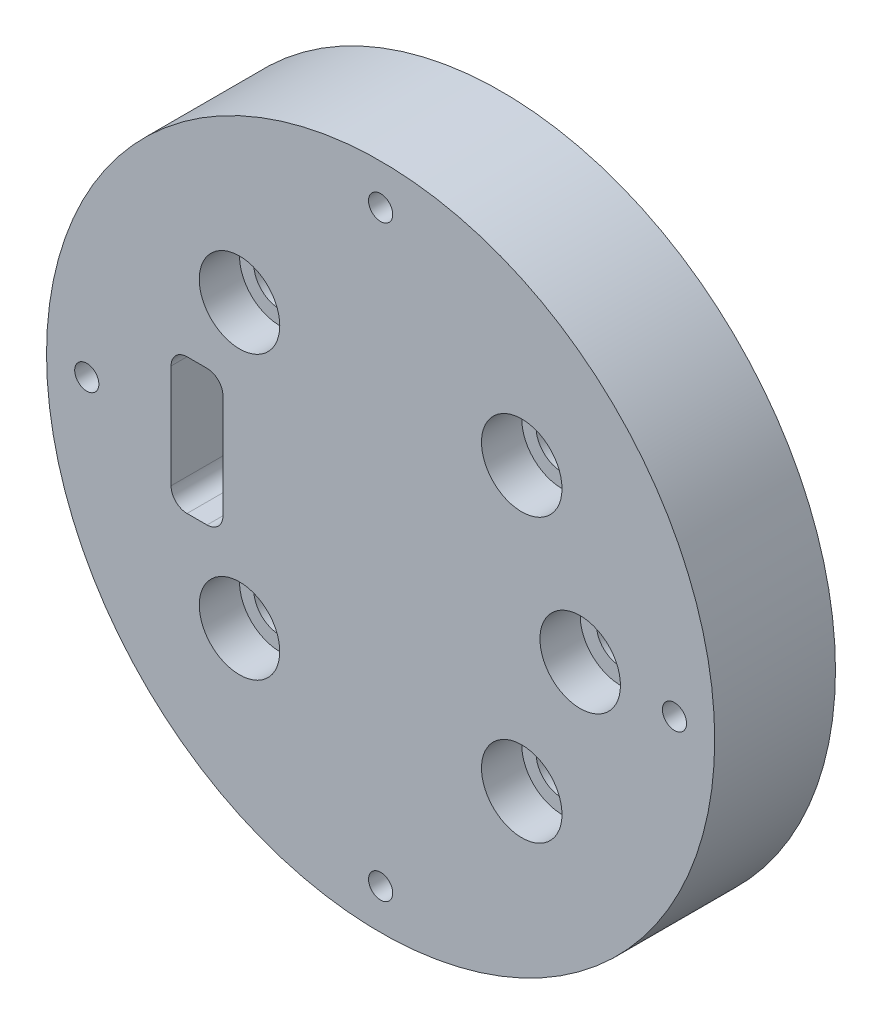
ISO-10303-21;
HEADER;
FILE_DESCRIPTION(('STEP AP214'),'2;1');
FILE_NAME('part.step','',(''),(''),'','','');
FILE_SCHEMA(('AUTOMOTIVE_DESIGN { 1 0 10303 214 1 1 1 1 }'));
ENDSEC;
DATA;
#1=APPLICATION_CONTEXT('core data for automotive mechanical design processes');
#2=APPLICATION_PROTOCOL_DEFINITION('international standard','automotive_design',2000,#1);
#3=PRODUCT_CONTEXT('',#1,'mechanical');
#4=PRODUCT('Part','Part','',(#3));
#5=PRODUCT_RELATED_PRODUCT_CATEGORY('part','',(#4));
#6=PRODUCT_DEFINITION_FORMATION('','',#4);
#7=PRODUCT_DEFINITION_CONTEXT('part definition',#1,'design');
#8=PRODUCT_DEFINITION('design','',#6,#7);
#9=PRODUCT_DEFINITION_SHAPE('','',#8);
#10=(LENGTH_UNIT() NAMED_UNIT(*) SI_UNIT(.MILLI.,.METRE.));
#11=(NAMED_UNIT(*) PLANE_ANGLE_UNIT() SI_UNIT($,.RADIAN.));
#12=(NAMED_UNIT(*) SI_UNIT($,.STERADIAN.) SOLID_ANGLE_UNIT());
#13=UNCERTAINTY_MEASURE_WITH_UNIT(LENGTH_MEASURE(1.E-05),#10,'distance_accuracy_value','');
#14=(GEOMETRIC_REPRESENTATION_CONTEXT(3) GLOBAL_UNCERTAINTY_ASSIGNED_CONTEXT((#13)) GLOBAL_UNIT_ASSIGNED_CONTEXT((#10,
#11,#12)) REPRESENTATION_CONTEXT('',''));
#15=CARTESIAN_POINT('',(0.,0.,0.));
#16=DIRECTION('',(0.,0.,1.));
#17=DIRECTION('',(1.,0.,0.));
#18=AXIS2_PLACEMENT_3D('',#15,#16,#17);
#19=CARTESIAN_POINT('',(-17.5285483543997,17.5285483543997,-10.));
#20=DIRECTION('',(0.,0.,1.));
#21=DIRECTION('',(1.,0.,0.));
#22=AXIS2_PLACEMENT_3D('',#19,#20,#21);
#23=CYLINDRICAL_SURFACE('',#22,3.22258440549561);
#24=CARTESIAN_POINT('',(-17.5285483543997,17.5285483543997,-10.));
#25=DIRECTION('',(0.,0.,1.));
#26=DIRECTION('',(1.,0.,0.));
#27=AXIS2_PLACEMENT_3D('',#24,#25,#26);
#28=CIRCLE('',#27,3.22258440549561);
#29=CARTESIAN_POINT('',(-14.3059639489041,17.5285483543997,-10.));
#30=VERTEX_POINT('',#29);
#31=EDGE_CURVE('E178',#30,#30,#28,.T.);
#32=ORIENTED_EDGE('',*,*,#31,.F.);
#33=EDGE_LOOP('',(#32));
#34=FACE_BOUND('',#33,.T.);
#35=CARTESIAN_POINT('',(-17.5285483543997,17.5285483543997,0.));
#36=DIRECTION('',(0.,0.,1.));
#37=DIRECTION('',(1.,0.,0.));
#38=AXIS2_PLACEMENT_3D('',#35,#36,#37);
#39=CIRCLE('',#38,3.22258440549561);
#40=CARTESIAN_POINT('',(-14.3059639489041,17.5285483543997,0.));
#41=VERTEX_POINT('',#40);
#42=EDGE_CURVE('E312',#41,#41,#39,.T.);
#43=ORIENTED_EDGE('',*,*,#42,.T.);
#44=EDGE_LOOP('',(#43));
#45=FACE_BOUND('',#44,.T.);
#46=ADVANCED_FACE('F41',(#34,#45),#23,.F.);
#47=CARTESIAN_POINT('',(-17.5285483543997,-17.5285483543997,-10.));
#48=DIRECTION('',(0.,0.,1.));
#49=DIRECTION('',(1.,0.,0.));
#50=AXIS2_PLACEMENT_3D('',#47,#48,#49);
#51=CYLINDRICAL_SURFACE('',#50,3.22258440549561);
#52=CARTESIAN_POINT('',(-17.5285483543997,-17.5285483543997,-10.));
#53=DIRECTION('',(0.,0.,1.));
#54=DIRECTION('',(1.,0.,0.));
#55=AXIS2_PLACEMENT_3D('',#52,#53,#54);
#56=CIRCLE('',#55,3.22258440549561);
#57=CARTESIAN_POINT('',(-14.3059639489041,-17.5285483543997,-10.));
#58=VERTEX_POINT('',#57);
#59=EDGE_CURVE('E174',#58,#58,#56,.T.);
#60=ORIENTED_EDGE('',*,*,#59,.F.);
#61=EDGE_LOOP('',(#60));
#62=FACE_BOUND('',#61,.T.);
#63=CARTESIAN_POINT('',(-17.5285483543997,-17.5285483543997,0.));
#64=DIRECTION('',(0.,0.,1.));
#65=DIRECTION('',(1.,0.,0.));
#66=AXIS2_PLACEMENT_3D('',#63,#64,#65);
#67=CIRCLE('',#66,3.22258440549561);
#68=CARTESIAN_POINT('',(-14.3059639489041,-17.5285483543997,0.));
#69=VERTEX_POINT('',#68);
#70=EDGE_CURVE('E316',#69,#69,#67,.T.);
#71=ORIENTED_EDGE('',*,*,#70,.T.);
#72=EDGE_LOOP('',(#71));
#73=FACE_BOUND('',#72,.T.);
#74=ADVANCED_FACE('F254',(#62,#73),#51,.F.);
#75=CARTESIAN_POINT('',(17.5285483543997,-17.5285483543997,-10.));
#76=DIRECTION('',(0.,0.,1.));
#77=DIRECTION('',(1.,0.,0.));
#78=AXIS2_PLACEMENT_3D('',#75,#76,#77);
#79=CYLINDRICAL_SURFACE('',#78,3.22258440549561);
#80=CARTESIAN_POINT('',(17.5285483543997,-17.5285483543997,-10.));
#81=DIRECTION('',(0.,0.,1.));
#82=DIRECTION('',(1.,0.,0.));
#83=AXIS2_PLACEMENT_3D('',#80,#81,#82);
#84=CIRCLE('',#83,3.22258440549561);
#85=CARTESIAN_POINT('',(20.7511327598953,-17.5285483543997,-10.));
#86=VERTEX_POINT('',#85);
#87=EDGE_CURVE('E170',#86,#86,#84,.T.);
#88=ORIENTED_EDGE('',*,*,#87,.F.);
#89=EDGE_LOOP('',(#88));
#90=FACE_BOUND('',#89,.T.);
#91=CARTESIAN_POINT('',(17.5285483543997,-17.5285483543997,0.));
#92=DIRECTION('',(0.,0.,1.));
#93=DIRECTION('',(1.,0.,0.));
#94=AXIS2_PLACEMENT_3D('',#91,#92,#93);
#95=CIRCLE('',#94,3.22258440549561);
#96=CARTESIAN_POINT('',(20.7511327598953,-17.5285483543997,0.));
#97=VERTEX_POINT('',#96);
#98=EDGE_CURVE('E300',#97,#97,#95,.T.);
#99=ORIENTED_EDGE('',*,*,#98,.T.);
#100=EDGE_LOOP('',(#99));
#101=FACE_BOUND('',#100,.T.);
#102=ADVANCED_FACE('F260',(#90,#101),#79,.F.);
#103=CARTESIAN_POINT('',(24.7891108115047,0.,-10.));
#104=DIRECTION('',(0.,0.,1.));
#105=DIRECTION('',(1.,0.,0.));
#106=AXIS2_PLACEMENT_3D('',#103,#104,#105);
#107=CYLINDRICAL_SURFACE('',#106,2.97469329738056);
#108=CARTESIAN_POINT('',(24.7891108115047,0.,-10.));
#109=DIRECTION('',(0.,0.,1.));
#110=DIRECTION('',(1.,0.,0.));
#111=AXIS2_PLACEMENT_3D('',#108,#109,#110);
#112=CIRCLE('',#111,2.97469329738056);
#113=CARTESIAN_POINT('',(27.7638041088852,0.,-10.));
#114=VERTEX_POINT('',#113);
#115=EDGE_CURVE('E166',#114,#114,#112,.T.);
#116=ORIENTED_EDGE('',*,*,#115,.F.);
#117=EDGE_LOOP('',(#116));
#118=FACE_BOUND('',#117,.T.);
#119=CARTESIAN_POINT('',(24.7891108115047,0.,0.));
#120=DIRECTION('',(0.,0.,1.));
#121=DIRECTION('',(1.,0.,0.));
#122=AXIS2_PLACEMENT_3D('',#119,#120,#121);
#123=CIRCLE('',#122,2.97469329738056);
#124=CARTESIAN_POINT('',(27.7638041088852,0.,0.));
#125=VERTEX_POINT('',#124);
#126=EDGE_CURVE('E280',#125,#125,#123,.T.);
#127=ORIENTED_EDGE('',*,*,#126,.T.);
#128=EDGE_LOOP('',(#127));
#129=FACE_BOUND('',#128,.T.);
#130=ADVANCED_FACE('F268',(#118,#129),#107,.F.);
#131=CARTESIAN_POINT('',(17.5285483543997,17.5285483543997,-10.));
#132=DIRECTION('',(0.,0.,1.));
#133=DIRECTION('',(1.,0.,0.));
#134=AXIS2_PLACEMENT_3D('',#131,#132,#133);
#135=CYLINDRICAL_SURFACE('',#134,3.22258440549561);
#136=CARTESIAN_POINT('',(17.5285483543997,17.5285483543997,-10.));
#137=DIRECTION('',(0.,0.,1.));
#138=DIRECTION('',(1.,0.,0.));
#139=AXIS2_PLACEMENT_3D('',#136,#137,#138);
#140=CIRCLE('',#139,3.22258440549561);
#141=CARTESIAN_POINT('',(20.7511327598953,17.5285483543997,-10.));
#142=VERTEX_POINT('',#141);
#143=EDGE_CURVE('E162',#142,#142,#140,.T.);
#144=ORIENTED_EDGE('',*,*,#143,.F.);
#145=EDGE_LOOP('',(#144));
#146=FACE_BOUND('',#145,.T.);
#147=CARTESIAN_POINT('',(17.5285483543997,17.5285483543997,0.));
#148=DIRECTION('',(0.,0.,1.));
#149=DIRECTION('',(1.,0.,0.));
#150=AXIS2_PLACEMENT_3D('',#147,#148,#149);
#151=CIRCLE('',#150,3.22258440549561);
#152=CARTESIAN_POINT('',(20.7511327598953,17.5285483543997,0.));
#153=VERTEX_POINT('',#152);
#154=EDGE_CURVE('E302',#153,#153,#151,.T.);
#155=ORIENTED_EDGE('',*,*,#154,.T.);
#156=EDGE_LOOP('',(#155));
#157=FACE_BOUND('',#156,.T.);
#158=ADVANCED_FACE('F43',(#146,#157),#135,.F.);
#159=CARTESIAN_POINT('',(-21.5665264060091,6.44516881099122,-10.));
#160=DIRECTION('',(0.,0.,1.));
#161=DIRECTION('',(1.,0.,0.));
#162=AXIS2_PLACEMENT_3D('',#159,#160,#161);
#163=CYLINDRICAL_SURFACE('',#162,1.98312886492038);
#164=DIRECTION('',(0.,0.,1.));
#165=VECTOR('',#164,1.);
#166=CARTESIAN_POINT('',(-19.5833975410887,6.44516881099122,-10.));
#167=LINE('',#166,#165);
#168=CARTESIAN_POINT('',(-19.5833975410887,6.44516881099122,-10.));
#169=VERTEX_POINT('',#168);
#170=CARTESIAN_POINT('',(-19.5833975410887,6.44516881099122,5.));
#171=VERTEX_POINT('',#170);
#172=EDGE_CURVE('E45',#169,#171,#167,.T.);
#173=ORIENTED_EDGE('',*,*,#172,.T.);
#174=CARTESIAN_POINT('',(-21.5665264060091,6.44516881099122,5.));
#175=DIRECTION('',(0.,0.,1.));
#176=DIRECTION('',(1.,0.,0.));
#177=AXIS2_PLACEMENT_3D('',#174,#175,#176);
#178=CIRCLE('',#177,1.98312886492038);
#179=CARTESIAN_POINT('',(-21.5665264060091,8.42829767591159,5.));
#180=VERTEX_POINT('',#179);
#181=EDGE_CURVE('E109',#171,#180,#178,.T.);
#182=ORIENTED_EDGE('',*,*,#181,.T.);
#183=DIRECTION('',(0.,0.,1.));
#184=VECTOR('',#183,1.);
#185=CARTESIAN_POINT('',(-21.5665264060091,8.42829767591159,-10.));
#186=LINE('',#185,#184);
#187=CARTESIAN_POINT('',(-21.5665264060091,8.42829767591159,-10.));
#188=VERTEX_POINT('',#187);
#189=EDGE_CURVE('E11',#188,#180,#186,.T.);
#190=ORIENTED_EDGE('',*,*,#189,.F.);
#191=CARTESIAN_POINT('',(-21.5665264060091,6.44516881099122,-10.));
#192=DIRECTION('',(0.,0.,1.));
#193=DIRECTION('',(1.,0.,0.));
#194=AXIS2_PLACEMENT_3D('',#191,#192,#193);
#195=CIRCLE('',#194,1.98312886492038);
#196=EDGE_CURVE('E111',#169,#188,#195,.T.);
#197=ORIENTED_EDGE('',*,*,#196,.F.);
#198=EDGE_LOOP('',(#173,#182,#190,#197));
#199=FACE_BOUND('',#198,.T.);
#200=ADVANCED_FACE('F107',(#199),#163,.F.);
#201=CARTESIAN_POINT('',(0.,8.42829767591159,-10.));
#202=DIRECTION('',(0.,1.,0.));
#203=DIRECTION('',(0.,0.,1.));
#204=AXIS2_PLACEMENT_3D('',#201,#202,#203);
#205=PLANE('',#204);
#206=ORIENTED_EDGE('',*,*,#189,.T.);
#207=DIRECTION('',(-1.,0.,0.));
#208=VECTOR('',#207,1.);
#209=CARTESIAN_POINT('',(0.,8.42829767591159,5.));
#210=LINE('',#209,#208);
#211=CARTESIAN_POINT('',(-24.0454374871595,8.42829767591159,5.));
#212=VERTEX_POINT('',#211);
#213=EDGE_CURVE('E127',#180,#212,#210,.T.);
#214=ORIENTED_EDGE('',*,*,#213,.T.);
#215=DIRECTION('',(0.,0.,1.));
#216=VECTOR('',#215,1.);
#217=CARTESIAN_POINT('',(-24.0454374871595,8.42829767591159,-10.));
#218=LINE('',#217,#216);
#219=CARTESIAN_POINT('',(-24.0454374871595,8.42829767591159,-10.));
#220=VERTEX_POINT('',#219);
#221=EDGE_CURVE('E51',#220,#212,#218,.T.);
#222=ORIENTED_EDGE('',*,*,#221,.F.);
#223=DIRECTION('',(-1.,0.,0.));
#224=VECTOR('',#223,1.);
#225=CARTESIAN_POINT('',(0.,8.42829767591159,-10.));
#226=LINE('',#225,#224);
#227=EDGE_CURVE('E58',#188,#220,#226,.T.);
#228=ORIENTED_EDGE('',*,*,#227,.F.);
#229=EDGE_LOOP('',(#206,#214,#222,#228));
#230=FACE_BOUND('',#229,.T.);
#231=ADVANCED_FACE('F243',(#230),#205,.F.);
#232=CARTESIAN_POINT('',(-24.0454374871595,6.44516881099122,-10.));
#233=DIRECTION('',(0.,0.,1.));
#234=DIRECTION('',(1.,0.,0.));
#235=AXIS2_PLACEMENT_3D('',#232,#233,#234);
#236=CYLINDRICAL_SURFACE('',#235,1.98312886492037);
#237=ORIENTED_EDGE('',*,*,#221,.T.);
#238=CARTESIAN_POINT('',(-24.0454374871595,6.44516881099122,5.));
#239=DIRECTION('',(0.,0.,1.));
#240=DIRECTION('',(1.,0.,0.));
#241=AXIS2_PLACEMENT_3D('',#238,#239,#240);
#242=CIRCLE('',#241,1.98312886492037);
#243=CARTESIAN_POINT('',(-26.0285663520799,6.44516881099122,5.));
#244=VERTEX_POINT('',#243);
#245=EDGE_CURVE('E152',#212,#244,#242,.T.);
#246=ORIENTED_EDGE('',*,*,#245,.T.);
#247=DIRECTION('',(0.,0.,1.));
#248=VECTOR('',#247,1.);
#249=CARTESIAN_POINT('',(-26.0285663520799,6.44516881099122,-10.));
#250=LINE('',#249,#248);
#251=CARTESIAN_POINT('',(-26.0285663520799,6.44516881099122,-10.));
#252=VERTEX_POINT('',#251);
#253=EDGE_CURVE('E209',#252,#244,#250,.T.);
#254=ORIENTED_EDGE('',*,*,#253,.F.);
#255=CARTESIAN_POINT('',(-24.0454374871595,6.44516881099122,-10.));
#256=DIRECTION('',(0.,0.,1.));
#257=DIRECTION('',(1.,0.,0.));
#258=AXIS2_PLACEMENT_3D('',#255,#256,#257);
#259=CIRCLE('',#258,1.98312886492037);
#260=EDGE_CURVE('E199',#220,#252,#259,.T.);
#261=ORIENTED_EDGE('',*,*,#260,.F.);
#262=EDGE_LOOP('',(#237,#246,#254,#261));
#263=FACE_BOUND('',#262,.T.);
#264=ADVANCED_FACE('F242',(#263),#236,.F.);
#265=CARTESIAN_POINT('',(-26.0285663520799,0.,-10.));
#266=DIRECTION('',(-1.,0.,0.));
#267=DIRECTION('',(0.,0.,1.));
#268=AXIS2_PLACEMENT_3D('',#265,#266,#267);
#269=PLANE('',#268);
#270=ORIENTED_EDGE('',*,*,#253,.T.);
#271=DIRECTION('',(0.,-1.,0.));
#272=VECTOR('',#271,1.);
#273=CARTESIAN_POINT('',(-26.0285663520799,0.,5.));
#274=LINE('',#273,#272);
#275=CARTESIAN_POINT('',(-26.0285663520799,-6.44516881099122,5.));
#276=VERTEX_POINT('',#275);
#277=EDGE_CURVE('E148',#244,#276,#274,.T.);
#278=ORIENTED_EDGE('',*,*,#277,.T.);
#279=DIRECTION('',(0.,0.,1.));
#280=VECTOR('',#279,1.);
#281=CARTESIAN_POINT('',(-26.0285663520799,-6.44516881099122,-10.));
#282=LINE('',#281,#280);
#283=CARTESIAN_POINT('',(-26.0285663520799,-6.44516881099122,-10.));
#284=VERTEX_POINT('',#283);
#285=EDGE_CURVE('E212',#284,#276,#282,.T.);
#286=ORIENTED_EDGE('',*,*,#285,.F.);
#287=DIRECTION('',(0.,-1.,0.));
#288=VECTOR('',#287,1.);
#289=CARTESIAN_POINT('',(-26.0285663520799,0.,-10.));
#290=LINE('',#289,#288);
#291=EDGE_CURVE('E196',#252,#284,#290,.T.);
#292=ORIENTED_EDGE('',*,*,#291,.F.);
#293=EDGE_LOOP('',(#270,#278,#286,#292));
#294=FACE_BOUND('',#293,.T.);
#295=ADVANCED_FACE('F237',(#294),#269,.F.);
#296=CARTESIAN_POINT('',(-24.0454374871595,-6.44516881099122,-10.));
#297=DIRECTION('',(0.,0.,1.));
#298=DIRECTION('',(1.,0.,0.));
#299=AXIS2_PLACEMENT_3D('',#296,#297,#298);
#300=CYLINDRICAL_SURFACE('',#299,1.98312886492037);
#301=ORIENTED_EDGE('',*,*,#285,.T.);
#302=CARTESIAN_POINT('',(-24.0454374871595,-6.44516881099122,5.));
#303=DIRECTION('',(0.,0.,1.));
#304=DIRECTION('',(1.,0.,0.));
#305=AXIS2_PLACEMENT_3D('',#302,#303,#304);
#306=CIRCLE('',#305,1.98312886492037);
#307=CARTESIAN_POINT('',(-24.0454374871595,-8.42829767591159,5.));
#308=VERTEX_POINT('',#307);
#309=EDGE_CURVE('E144',#276,#308,#306,.T.);
#310=ORIENTED_EDGE('',*,*,#309,.T.);
#311=DIRECTION('',(0.,0.,1.));
#312=VECTOR('',#311,1.);
#313=CARTESIAN_POINT('',(-24.0454374871595,-8.42829767591159,-10.));
#314=LINE('',#313,#312);
#315=CARTESIAN_POINT('',(-24.0454374871595,-8.42829767591159,-10.));
#316=VERTEX_POINT('',#315);
#317=EDGE_CURVE('E215',#316,#308,#314,.T.);
#318=ORIENTED_EDGE('',*,*,#317,.F.);
#319=CARTESIAN_POINT('',(-24.0454374871595,-6.44516881099122,-10.));
#320=DIRECTION('',(0.,0.,1.));
#321=DIRECTION('',(1.,0.,0.));
#322=AXIS2_PLACEMENT_3D('',#319,#320,#321);
#323=CIRCLE('',#322,1.98312886492037);
#324=EDGE_CURVE('E193',#284,#316,#323,.T.);
#325=ORIENTED_EDGE('',*,*,#324,.F.);
#326=EDGE_LOOP('',(#301,#310,#318,#325));
#327=FACE_BOUND('',#326,.T.);
#328=ADVANCED_FACE('F233',(#327),#300,.F.);
#329=CARTESIAN_POINT('',(0.,-8.42829767591159,-10.));
#330=DIRECTION('',(0.,-1.,0.));
#331=DIRECTION('',(0.,0.,-1.));
#332=AXIS2_PLACEMENT_3D('',#329,#330,#331);
#333=PLANE('',#332);
#334=ORIENTED_EDGE('',*,*,#317,.T.);
#335=DIRECTION('',(1.,0.,0.));
#336=VECTOR('',#335,1.);
#337=CARTESIAN_POINT('',(0.,-8.42829767591159,5.));
#338=LINE('',#337,#336);
#339=CARTESIAN_POINT('',(-21.5665264060091,-8.42829767591159,5.));
#340=VERTEX_POINT('',#339);
#341=EDGE_CURVE('E137',#308,#340,#338,.T.);
#342=ORIENTED_EDGE('',*,*,#341,.T.);
#343=DIRECTION('',(0.,0.,1.));
#344=VECTOR('',#343,1.);
#345=CARTESIAN_POINT('',(-21.5665264060091,-8.42829767591159,-10.));
#346=LINE('',#345,#344);
#347=CARTESIAN_POINT('',(-21.5665264060091,-8.42829767591159,-10.));
#348=VERTEX_POINT('',#347);
#349=EDGE_CURVE('E218',#348,#340,#346,.T.);
#350=ORIENTED_EDGE('',*,*,#349,.F.);
#351=DIRECTION('',(1.,0.,0.));
#352=VECTOR('',#351,1.);
#353=CARTESIAN_POINT('',(0.,-8.42829767591159,-10.));
#354=LINE('',#353,#352);
#355=EDGE_CURVE('E190',#316,#348,#354,.T.);
#356=ORIENTED_EDGE('',*,*,#355,.F.);
#357=EDGE_LOOP('',(#334,#342,#350,#356));
#358=FACE_BOUND('',#357,.T.);
#359=ADVANCED_FACE('F229',(#358),#333,.F.);
#360=CARTESIAN_POINT('',(-21.5665264060091,-6.44516881099122,-10.));
#361=DIRECTION('',(0.,0.,1.));
#362=DIRECTION('',(1.,0.,0.));
#363=AXIS2_PLACEMENT_3D('',#360,#361,#362);
#364=CYLINDRICAL_SURFACE('',#363,1.98312886492037);
#365=ORIENTED_EDGE('',*,*,#349,.T.);
#366=CARTESIAN_POINT('',(-21.5665264060091,-6.44516881099122,5.));
#367=DIRECTION('',(0.,0.,1.));
#368=DIRECTION('',(1.,0.,0.));
#369=AXIS2_PLACEMENT_3D('',#366,#367,#368);
#370=CIRCLE('',#369,1.98312886492037);
#371=CARTESIAN_POINT('',(-19.5833975410887,-6.44516881099122,5.));
#372=VERTEX_POINT('',#371);
#373=EDGE_CURVE('E134',#340,#372,#370,.T.);
#374=ORIENTED_EDGE('',*,*,#373,.T.);
#375=DIRECTION('',(0.,0.,1.));
#376=VECTOR('',#375,1.);
#377=CARTESIAN_POINT('',(-19.5833975410887,-6.44516881099122,-10.));
#378=LINE('',#377,#376);
#379=CARTESIAN_POINT('',(-19.5833975410887,-6.44516881099122,-10.));
#380=VERTEX_POINT('',#379);
#381=EDGE_CURVE('E116',#380,#372,#378,.T.);
#382=ORIENTED_EDGE('',*,*,#381,.F.);
#383=CARTESIAN_POINT('',(-21.5665264060091,-6.44516881099122,-10.));
#384=DIRECTION('',(0.,0.,1.));
#385=DIRECTION('',(1.,0.,0.));
#386=AXIS2_PLACEMENT_3D('',#383,#384,#385);
#387=CIRCLE('',#386,1.98312886492037);
#388=EDGE_CURVE('E187',#348,#380,#387,.T.);
#389=ORIENTED_EDGE('',*,*,#388,.F.);
#390=EDGE_LOOP('',(#365,#374,#382,#389));
#391=FACE_BOUND('',#390,.T.);
#392=ADVANCED_FACE('F224',(#391),#364,.F.);
#393=CARTESIAN_POINT('',(-19.5833975410887,0.,-10.));
#394=DIRECTION('',(1.,0.,0.));
#395=DIRECTION('',(0.,0.,-1.));
#396=AXIS2_PLACEMENT_3D('',#393,#394,#395);
#397=PLANE('',#396);
#398=ORIENTED_EDGE('',*,*,#381,.T.);
#399=DIRECTION('',(0.,1.,0.));
#400=VECTOR('',#399,1.);
#401=CARTESIAN_POINT('',(-19.5833975410887,0.,5.));
#402=LINE('',#401,#400);
#403=EDGE_CURVE('E123',#372,#171,#402,.T.);
#404=ORIENTED_EDGE('',*,*,#403,.T.);
#405=ORIENTED_EDGE('',*,*,#172,.F.);
#406=DIRECTION('',(0.,1.,0.));
#407=VECTOR('',#406,1.);
#408=CARTESIAN_POINT('',(-19.5833975410887,0.,-10.));
#409=LINE('',#408,#407);
#410=EDGE_CURVE('E184',#380,#169,#409,.T.);
#411=ORIENTED_EDGE('',*,*,#410,.F.);
#412=EDGE_LOOP('',(#398,#404,#405,#411));
#413=FACE_BOUND('',#412,.T.);
#414=ADVANCED_FACE('F131',(#413),#397,.F.);
#415=CARTESIAN_POINT('',(0.,0.,-10.));
#416=DIRECTION('',(0.,0.,1.));
#417=DIRECTION('',(1.,0.,0.));
#418=AXIS2_PLACEMENT_3D('',#415,#416,#417);
#419=CYLINDRICAL_SURFACE('',#418,41.5);
#420=CARTESIAN_POINT('',(0.,0.,-10.));
#421=DIRECTION('',(0.,0.,1.));
#422=DIRECTION('',(1.,0.,0.));
#423=AXIS2_PLACEMENT_3D('',#420,#421,#422);
#424=CIRCLE('',#423,41.5);
#425=CARTESIAN_POINT('',(41.5,0.,-10.));
#426=VERTEX_POINT('',#425);
#427=EDGE_CURVE('E117',#426,#426,#424,.T.);
#428=ORIENTED_EDGE('',*,*,#427,.T.);
#429=EDGE_LOOP('',(#428));
#430=FACE_BOUND('',#429,.T.);
#431=CARTESIAN_POINT('',(0.,0.,5.));
#432=DIRECTION('',(0.,0.,1.));
#433=DIRECTION('',(1.,0.,0.));
#434=AXIS2_PLACEMENT_3D('',#431,#432,#433);
#435=CIRCLE('',#434,41.5);
#436=CARTESIAN_POINT('',(41.5,0.,5.));
#437=VERTEX_POINT('',#436);
#438=EDGE_CURVE('E158',#437,#437,#435,.T.);
#439=ORIENTED_EDGE('',*,*,#438,.F.);
#440=EDGE_LOOP('',(#439));
#441=FACE_BOUND('',#440,.T.);
#442=ADVANCED_FACE('F351',(#430,#441),#419,.T.);
#443=CARTESIAN_POINT('',(0.,0.,-10.));
#444=DIRECTION('',(0.,0.,1.));
#445=DIRECTION('',(1.,0.,0.));
#446=AXIS2_PLACEMENT_3D('',#443,#444,#445);
#447=PLANE('',#446);
#448=CARTESIAN_POINT('',(-36.5,0.,-10.));
#449=DIRECTION('',(0.,0.,1.));
#450=DIRECTION('',(1.,0.,0.));
#451=AXIS2_PLACEMENT_3D('',#448,#449,#450);
#452=CIRCLE('',#451,1.5);
#453=CARTESIAN_POINT('',(-35.,0.,-10.));
#454=VERTEX_POINT('',#453);
#455=EDGE_CURVE('E284',#454,#454,#452,.T.);
#456=ORIENTED_EDGE('',*,*,#455,.T.);
#457=EDGE_LOOP('',(#456));
#458=FACE_BOUND('',#457,.T.);
#459=CARTESIAN_POINT('',(0.,-36.5,-10.));
#460=DIRECTION('',(0.,0.,1.));
#461=DIRECTION('',(1.,0.,0.));
#462=AXIS2_PLACEMENT_3D('',#459,#460,#461);
#463=CIRCLE('',#462,1.5);
#464=CARTESIAN_POINT('',(1.5,-36.5,-10.));
#465=VERTEX_POINT('',#464);
#466=EDGE_CURVE('E583',#465,#465,#463,.T.);
#467=ORIENTED_EDGE('',*,*,#466,.T.);
#468=EDGE_LOOP('',(#467));
#469=FACE_BOUND('',#468,.T.);
#470=CARTESIAN_POINT('',(36.5,0.,-10.));
#471=DIRECTION('',(0.,0.,1.));
#472=DIRECTION('',(1.,0.,0.));
#473=AXIS2_PLACEMENT_3D('',#470,#471,#472);
#474=CIRCLE('',#473,1.5);
#475=CARTESIAN_POINT('',(38.,0.,-10.));
#476=VERTEX_POINT('',#475);
#477=EDGE_CURVE('E593',#476,#476,#474,.T.);
#478=ORIENTED_EDGE('',*,*,#477,.T.);
#479=EDGE_LOOP('',(#478));
#480=FACE_BOUND('',#479,.T.);
#481=CARTESIAN_POINT('',(0.,36.5,-10.));
#482=DIRECTION('',(0.,0.,1.));
#483=DIRECTION('',(1.,0.,0.));
#484=AXIS2_PLACEMENT_3D('',#481,#482,#483);
#485=CIRCLE('',#484,1.5);
#486=CARTESIAN_POINT('',(1.5,36.5,-10.));
#487=VERTEX_POINT('',#486);
#488=EDGE_CURVE('E601',#487,#487,#485,.T.);
#489=ORIENTED_EDGE('',*,*,#488,.T.);
#490=EDGE_LOOP('',(#489));
#491=FACE_BOUND('',#490,.T.);
#492=ORIENTED_EDGE('',*,*,#143,.T.);
#493=EDGE_LOOP('',(#492));
#494=FACE_BOUND('',#493,.T.);
#495=ORIENTED_EDGE('',*,*,#115,.T.);
#496=EDGE_LOOP('',(#495));
#497=FACE_BOUND('',#496,.T.);
#498=ORIENTED_EDGE('',*,*,#87,.T.);
#499=EDGE_LOOP('',(#498));
#500=FACE_BOUND('',#499,.T.);
#501=ORIENTED_EDGE('',*,*,#59,.T.);
#502=EDGE_LOOP('',(#501));
#503=FACE_BOUND('',#502,.T.);
#504=ORIENTED_EDGE('',*,*,#31,.T.);
#505=EDGE_LOOP('',(#504));
#506=FACE_BOUND('',#505,.T.);
#507=ORIENTED_EDGE('',*,*,#196,.T.);
#508=ORIENTED_EDGE('',*,*,#227,.T.);
#509=ORIENTED_EDGE('',*,*,#260,.T.);
#510=ORIENTED_EDGE('',*,*,#291,.T.);
#511=ORIENTED_EDGE('',*,*,#324,.T.);
#512=ORIENTED_EDGE('',*,*,#355,.T.);
#513=ORIENTED_EDGE('',*,*,#388,.T.);
#514=ORIENTED_EDGE('',*,*,#410,.T.);
#515=EDGE_LOOP('',(#507,#508,#509,#510,#511,#512,#513,#514));
#516=FACE_BOUND('',#515,.T.);
#517=ORIENTED_EDGE('',*,*,#427,.F.);
#518=EDGE_LOOP('',(#517));
#519=FACE_BOUND('',#518,.T.);
#520=ADVANCED_FACE('F341',(#458,#469,#480,#491,#494,#497,#500,#503,#506,#516,#519),#447,.F.);
#521=CARTESIAN_POINT('',(0.,0.,5.));
#522=DIRECTION('',(0.,0.,1.));
#523=DIRECTION('',(1.,0.,0.));
#524=AXIS2_PLACEMENT_3D('',#521,#522,#523);
#525=PLANE('',#524);
#526=CARTESIAN_POINT('',(-36.5,0.,5.));
#527=DIRECTION('',(0.,0.,1.));
#528=DIRECTION('',(1.,0.,0.));
#529=AXIS2_PLACEMENT_3D('',#526,#527,#528);
#530=CIRCLE('',#529,1.5);
#531=CARTESIAN_POINT('',(-35.,0.,5.));
#532=VERTEX_POINT('',#531);
#533=EDGE_CURVE('E292',#532,#532,#530,.T.);
#534=ORIENTED_EDGE('',*,*,#533,.F.);
#535=EDGE_LOOP('',(#534));
#536=FACE_BOUND('',#535,.T.);
#537=CARTESIAN_POINT('',(0.,-36.5,5.));
#538=DIRECTION('',(0.,0.,1.));
#539=DIRECTION('',(1.,0.,0.));
#540=AXIS2_PLACEMENT_3D('',#537,#538,#539);
#541=CIRCLE('',#540,1.5);
#542=CARTESIAN_POINT('',(1.5,-36.5,5.));
#543=VERTEX_POINT('',#542);
#544=EDGE_CURVE('E587',#543,#543,#541,.T.);
#545=ORIENTED_EDGE('',*,*,#544,.F.);
#546=EDGE_LOOP('',(#545));
#547=FACE_BOUND('',#546,.T.);
#548=CARTESIAN_POINT('',(36.5,0.,5.));
#549=DIRECTION('',(0.,0.,1.));
#550=DIRECTION('',(1.,0.,0.));
#551=AXIS2_PLACEMENT_3D('',#548,#549,#550);
#552=CIRCLE('',#551,1.5);
#553=CARTESIAN_POINT('',(38.,0.,5.));
#554=VERTEX_POINT('',#553);
#555=EDGE_CURVE('E597',#554,#554,#552,.T.);
#556=ORIENTED_EDGE('',*,*,#555,.F.);
#557=EDGE_LOOP('',(#556));
#558=FACE_BOUND('',#557,.T.);
#559=CARTESIAN_POINT('',(0.,36.5,5.));
#560=DIRECTION('',(0.,0.,1.));
#561=DIRECTION('',(1.,0.,0.));
#562=AXIS2_PLACEMENT_3D('',#559,#560,#561);
#563=CIRCLE('',#562,1.5);
#564=CARTESIAN_POINT('',(1.5,36.5,5.));
#565=VERTEX_POINT('',#564);
#566=EDGE_CURVE('E605',#565,#565,#563,.T.);
#567=ORIENTED_EDGE('',*,*,#566,.F.);
#568=EDGE_LOOP('',(#567));
#569=FACE_BOUND('',#568,.T.);
#570=CARTESIAN_POINT('',(17.5285483543997,17.5285483543997,5.));
#571=DIRECTION('',(0.,0.,1.));
#572=DIRECTION('',(1.,0.,0.));
#573=AXIS2_PLACEMENT_3D('',#570,#571,#572);
#574=CIRCLE('',#573,5.);
#575=CARTESIAN_POINT('',(22.5285483543997,17.5285483543997,5.));
#576=VERTEX_POINT('',#575);
#577=EDGE_CURVE('E306',#576,#576,#574,.T.);
#578=ORIENTED_EDGE('',*,*,#577,.F.);
#579=EDGE_LOOP('',(#578));
#580=FACE_BOUND('',#579,.T.);
#581=CARTESIAN_POINT('',(-17.5285483543997,-17.5285483543997,5.));
#582=DIRECTION('',(0.,0.,1.));
#583=DIRECTION('',(1.,0.,0.));
#584=AXIS2_PLACEMENT_3D('',#581,#582,#583);
#585=CIRCLE('',#584,5.);
#586=CARTESIAN_POINT('',(-12.5285483543997,-17.5285483543997,5.));
#587=VERTEX_POINT('',#586);
#588=EDGE_CURVE('E320',#587,#587,#585,.T.);
#589=ORIENTED_EDGE('',*,*,#588,.F.);
#590=EDGE_LOOP('',(#589));
#591=FACE_BOUND('',#590,.T.);
#592=CARTESIAN_POINT('',(17.5285483543997,-17.5285483543997,5.));
#593=DIRECTION('',(0.,0.,1.));
#594=DIRECTION('',(1.,0.,0.));
#595=AXIS2_PLACEMENT_3D('',#592,#593,#594);
#596=CIRCLE('',#595,5.);
#597=CARTESIAN_POINT('',(22.5285483543997,-17.5285483543997,5.));
#598=VERTEX_POINT('',#597);
#599=EDGE_CURVE('E296',#598,#598,#596,.T.);
#600=ORIENTED_EDGE('',*,*,#599,.F.);
#601=EDGE_LOOP('',(#600));
#602=FACE_BOUND('',#601,.T.);
#603=CARTESIAN_POINT('',(24.7891108115047,0.,5.));
#604=DIRECTION('',(0.,0.,1.));
#605=DIRECTION('',(1.,0.,0.));
#606=AXIS2_PLACEMENT_3D('',#603,#604,#605);
#607=CIRCLE('',#606,5.);
#608=CARTESIAN_POINT('',(29.7891108115047,0.,5.));
#609=VERTEX_POINT('',#608);
#610=EDGE_CURVE('E283',#609,#609,#607,.T.);
#611=ORIENTED_EDGE('',*,*,#610,.F.);
#612=EDGE_LOOP('',(#611));
#613=FACE_BOUND('',#612,.T.);
#614=CARTESIAN_POINT('',(-17.5285483543997,17.5285483543997,5.));
#615=DIRECTION('',(0.,0.,1.));
#616=DIRECTION('',(1.,0.,0.));
#617=AXIS2_PLACEMENT_3D('',#614,#615,#616);
#618=CIRCLE('',#617,5.);
#619=CARTESIAN_POINT('',(-12.5285483543997,17.5285483543997,5.));
#620=VERTEX_POINT('',#619);
#621=EDGE_CURVE('E331',#620,#620,#618,.T.);
#622=ORIENTED_EDGE('',*,*,#621,.F.);
#623=EDGE_LOOP('',(#622));
#624=FACE_BOUND('',#623,.T.);
#625=ORIENTED_EDGE('',*,*,#181,.F.);
#626=ORIENTED_EDGE('',*,*,#403,.F.);
#627=ORIENTED_EDGE('',*,*,#373,.F.);
#628=ORIENTED_EDGE('',*,*,#341,.F.);
#629=ORIENTED_EDGE('',*,*,#309,.F.);
#630=ORIENTED_EDGE('',*,*,#277,.F.);
#631=ORIENTED_EDGE('',*,*,#245,.F.);
#632=ORIENTED_EDGE('',*,*,#213,.F.);
#633=EDGE_LOOP('',(#625,#626,#627,#628,#629,#630,#631,#632));
#634=FACE_BOUND('',#633,.T.);
#635=ORIENTED_EDGE('',*,*,#438,.T.);
#636=EDGE_LOOP('',(#635));
#637=FACE_BOUND('',#636,.T.);
#638=ADVANCED_FACE('F120',(#536,#547,#558,#569,#580,#591,#602,#613,#624,#634,#637),#525,.T.);
#639=CARTESIAN_POINT('',(-17.5285483543997,17.5285483543997,0.));
#640=DIRECTION('',(0.,0.,1.));
#641=DIRECTION('',(1.,0.,0.));
#642=AXIS2_PLACEMENT_3D('',#639,#640,#641);
#643=CYLINDRICAL_SURFACE('',#642,5.);
#644=CARTESIAN_POINT('',(-17.5285483543997,17.5285483543997,0.));
#645=DIRECTION('',(0.,0.,1.));
#646=DIRECTION('',(1.,0.,0.));
#647=AXIS2_PLACEMENT_3D('',#644,#645,#646);
#648=CIRCLE('',#647,5.);
#649=CARTESIAN_POINT('',(-12.5285483543997,17.5285483543997,0.));
#650=VERTEX_POINT('',#649);
#651=EDGE_CURVE('E129',#650,#650,#648,.T.);
#652=ORIENTED_EDGE('',*,*,#651,.F.);
#653=EDGE_LOOP('',(#652));
#654=FACE_BOUND('',#653,.T.);
#655=ORIENTED_EDGE('',*,*,#621,.T.);
#656=EDGE_LOOP('',(#655));
#657=FACE_BOUND('',#656,.T.);
#658=ADVANCED_FACE('F338',(#654,#657),#643,.F.);
#659=CARTESIAN_POINT('',(-17.5285483543997,17.5285483543997,0.));
#660=DIRECTION('',(0.,0.,1.));
#661=DIRECTION('',(1.,0.,0.));
#662=AXIS2_PLACEMENT_3D('',#659,#660,#661);
#663=PLANE('',#662);
#664=ORIENTED_EDGE('',*,*,#42,.F.);
#665=EDGE_LOOP('',(#664));
#666=FACE_BOUND('',#665,.T.);
#667=ORIENTED_EDGE('',*,*,#651,.T.);
#668=EDGE_LOOP('',(#667));
#669=FACE_BOUND('',#668,.T.);
#670=ADVANCED_FACE('F348',(#666,#669),#663,.T.);
#671=CARTESIAN_POINT('',(24.7891108115047,0.,0.));
#672=DIRECTION('',(0.,0.,1.));
#673=DIRECTION('',(1.,0.,0.));
#674=AXIS2_PLACEMENT_3D('',#671,#672,#673);
#675=CYLINDRICAL_SURFACE('',#674,5.);
#676=CARTESIAN_POINT('',(24.7891108115047,0.,0.));
#677=DIRECTION('',(0.,0.,1.));
#678=DIRECTION('',(1.,0.,0.));
#679=AXIS2_PLACEMENT_3D('',#676,#677,#678);
#680=CIRCLE('',#679,5.);
#681=CARTESIAN_POINT('',(29.7891108115047,0.,0.));
#682=VERTEX_POINT('',#681);
#683=EDGE_CURVE('E289',#682,#682,#680,.T.);
#684=ORIENTED_EDGE('',*,*,#683,.F.);
#685=EDGE_LOOP('',(#684));
#686=FACE_BOUND('',#685,.T.);
#687=ORIENTED_EDGE('',*,*,#610,.T.);
#688=EDGE_LOOP('',(#687));
#689=FACE_BOUND('',#688,.T.);
#690=ADVANCED_FACE('F448',(#686,#689),#675,.F.);
#691=CARTESIAN_POINT('',(24.7891108115047,0.,0.));
#692=DIRECTION('',(0.,0.,1.));
#693=DIRECTION('',(1.,0.,0.));
#694=AXIS2_PLACEMENT_3D('',#691,#692,#693);
#695=PLANE('',#694);
#696=ORIENTED_EDGE('',*,*,#126,.F.);
#697=EDGE_LOOP('',(#696));
#698=FACE_BOUND('',#697,.T.);
#699=ORIENTED_EDGE('',*,*,#683,.T.);
#700=EDGE_LOOP('',(#699));
#701=FACE_BOUND('',#700,.T.);
#702=ADVANCED_FACE('F457',(#698,#701),#695,.T.);
#703=CARTESIAN_POINT('',(17.5285483543997,-17.5285483543997,0.));
#704=DIRECTION('',(0.,0.,1.));
#705=DIRECTION('',(1.,0.,0.));
#706=AXIS2_PLACEMENT_3D('',#703,#704,#705);
#707=CYLINDRICAL_SURFACE('',#706,5.);
#708=CARTESIAN_POINT('',(17.5285483543997,-17.5285483543997,0.));
#709=DIRECTION('',(0.,0.,1.));
#710=DIRECTION('',(1.,0.,0.));
#711=AXIS2_PLACEMENT_3D('',#708,#709,#710);
#712=CIRCLE('',#711,5.);
#713=CARTESIAN_POINT('',(22.5285483543997,-17.5285483543997,0.));
#714=VERTEX_POINT('',#713);
#715=EDGE_CURVE('E321',#714,#714,#712,.T.);
#716=ORIENTED_EDGE('',*,*,#715,.F.);
#717=EDGE_LOOP('',(#716));
#718=FACE_BOUND('',#717,.T.);
#719=ORIENTED_EDGE('',*,*,#599,.T.);
#720=EDGE_LOOP('',(#719));
#721=FACE_BOUND('',#720,.T.);
#722=ADVANCED_FACE('F467',(#718,#721),#707,.F.);
#723=CARTESIAN_POINT('',(17.5285483543997,-17.5285483543997,0.));
#724=DIRECTION('',(0.,0.,1.));
#725=DIRECTION('',(1.,0.,0.));
#726=AXIS2_PLACEMENT_3D('',#723,#724,#725);
#727=PLANE('',#726);
#728=ORIENTED_EDGE('',*,*,#98,.F.);
#729=EDGE_LOOP('',(#728));
#730=FACE_BOUND('',#729,.T.);
#731=ORIENTED_EDGE('',*,*,#715,.T.);
#732=EDGE_LOOP('',(#731));
#733=FACE_BOUND('',#732,.T.);
#734=ADVANCED_FACE('F476',(#730,#733),#727,.T.);
#735=CARTESIAN_POINT('',(-17.5285483543997,-17.5285483543997,0.));
#736=DIRECTION('',(0.,0.,1.));
#737=DIRECTION('',(1.,0.,0.));
#738=AXIS2_PLACEMENT_3D('',#735,#736,#737);
#739=CYLINDRICAL_SURFACE('',#738,5.);
#740=CARTESIAN_POINT('',(-17.5285483543997,-17.5285483543997,0.));
#741=DIRECTION('',(0.,0.,1.));
#742=DIRECTION('',(1.,0.,0.));
#743=AXIS2_PLACEMENT_3D('',#740,#741,#742);
#744=CIRCLE('',#743,5.);
#745=CARTESIAN_POINT('',(-12.5285483543997,-17.5285483543997,0.));
#746=VERTEX_POINT('',#745);
#747=EDGE_CURVE('E307',#746,#746,#744,.T.);
#748=ORIENTED_EDGE('',*,*,#747,.F.);
#749=EDGE_LOOP('',(#748));
#750=FACE_BOUND('',#749,.T.);
#751=ORIENTED_EDGE('',*,*,#588,.T.);
#752=EDGE_LOOP('',(#751));
#753=FACE_BOUND('',#752,.T.);
#754=ADVANCED_FACE('F486',(#750,#753),#739,.F.);
#755=CARTESIAN_POINT('',(-17.5285483543997,-17.5285483543997,0.));
#756=DIRECTION('',(0.,0.,1.));
#757=DIRECTION('',(1.,0.,0.));
#758=AXIS2_PLACEMENT_3D('',#755,#756,#757);
#759=PLANE('',#758);
#760=ORIENTED_EDGE('',*,*,#70,.F.);
#761=EDGE_LOOP('',(#760));
#762=FACE_BOUND('',#761,.T.);
#763=ORIENTED_EDGE('',*,*,#747,.T.);
#764=EDGE_LOOP('',(#763));
#765=FACE_BOUND('',#764,.T.);
#766=ADVANCED_FACE('F496',(#762,#765),#759,.T.);
#767=CARTESIAN_POINT('',(17.5285483543997,17.5285483543997,0.));
#768=DIRECTION('',(0.,0.,1.));
#769=DIRECTION('',(1.,0.,0.));
#770=AXIS2_PLACEMENT_3D('',#767,#768,#769);
#771=CYLINDRICAL_SURFACE('',#770,5.);
#772=CARTESIAN_POINT('',(17.5285483543997,17.5285483543997,0.));
#773=DIRECTION('',(0.,0.,1.));
#774=DIRECTION('',(1.,0.,0.));
#775=AXIS2_PLACEMENT_3D('',#772,#773,#774);
#776=CIRCLE('',#775,5.);
#777=CARTESIAN_POINT('',(22.5285483543997,17.5285483543997,0.));
#778=VERTEX_POINT('',#777);
#779=EDGE_CURVE('E308',#778,#778,#776,.T.);
#780=ORIENTED_EDGE('',*,*,#779,.F.);
#781=EDGE_LOOP('',(#780));
#782=FACE_BOUND('',#781,.T.);
#783=ORIENTED_EDGE('',*,*,#577,.T.);
#784=EDGE_LOOP('',(#783));
#785=FACE_BOUND('',#784,.T.);
#786=ADVANCED_FACE('F506',(#782,#785),#771,.F.);
#787=CARTESIAN_POINT('',(17.5285483543997,17.5285483543997,0.));
#788=DIRECTION('',(0.,0.,1.));
#789=DIRECTION('',(1.,0.,0.));
#790=AXIS2_PLACEMENT_3D('',#787,#788,#789);
#791=PLANE('',#790);
#792=ORIENTED_EDGE('',*,*,#154,.F.);
#793=EDGE_LOOP('',(#792));
#794=FACE_BOUND('',#793,.T.);
#795=ORIENTED_EDGE('',*,*,#779,.T.);
#796=EDGE_LOOP('',(#795));
#797=FACE_BOUND('',#796,.T.);
#798=ADVANCED_FACE('F516',(#794,#797),#791,.T.);
#799=CARTESIAN_POINT('',(0.,36.5,-10.));
#800=DIRECTION('',(0.,0.,1.));
#801=DIRECTION('',(1.,0.,0.));
#802=AXIS2_PLACEMENT_3D('',#799,#800,#801);
#803=CYLINDRICAL_SURFACE('',#802,1.5);
#804=ORIENTED_EDGE('',*,*,#488,.F.);
#805=EDGE_LOOP('',(#804));
#806=FACE_BOUND('',#805,.T.);
#807=ORIENTED_EDGE('',*,*,#566,.T.);
#808=EDGE_LOOP('',(#807));
#809=FACE_BOUND('',#808,.T.);
#810=ADVANCED_FACE('F526',(#806,#809),#803,.F.);
#811=CARTESIAN_POINT('',(36.5,0.,-10.));
#812=DIRECTION('',(0.,0.,1.));
#813=DIRECTION('',(1.,0.,0.));
#814=AXIS2_PLACEMENT_3D('',#811,#812,#813);
#815=CYLINDRICAL_SURFACE('',#814,1.5);
#816=ORIENTED_EDGE('',*,*,#477,.F.);
#817=EDGE_LOOP('',(#816));
#818=FACE_BOUND('',#817,.T.);
#819=ORIENTED_EDGE('',*,*,#555,.T.);
#820=EDGE_LOOP('',(#819));
#821=FACE_BOUND('',#820,.T.);
#822=ADVANCED_FACE('F545',(#818,#821),#815,.F.);
#823=CARTESIAN_POINT('',(0.,-36.5,-10.));
#824=DIRECTION('',(0.,0.,1.));
#825=DIRECTION('',(1.,0.,0.));
#826=AXIS2_PLACEMENT_3D('',#823,#824,#825);
#827=CYLINDRICAL_SURFACE('',#826,1.5);
#828=ORIENTED_EDGE('',*,*,#466,.F.);
#829=EDGE_LOOP('',(#828));
#830=FACE_BOUND('',#829,.T.);
#831=ORIENTED_EDGE('',*,*,#544,.T.);
#832=EDGE_LOOP('',(#831));
#833=FACE_BOUND('',#832,.T.);
#834=ADVANCED_FACE('F555',(#830,#833),#827,.F.);
#835=CARTESIAN_POINT('',(-36.5,0.,-10.));
#836=DIRECTION('',(0.,0.,1.));
#837=DIRECTION('',(1.,0.,0.));
#838=AXIS2_PLACEMENT_3D('',#835,#836,#837);
#839=CYLINDRICAL_SURFACE('',#838,1.5);
#840=ORIENTED_EDGE('',*,*,#455,.F.);
#841=EDGE_LOOP('',(#840));
#842=FACE_BOUND('',#841,.T.);
#843=ORIENTED_EDGE('',*,*,#533,.T.);
#844=EDGE_LOOP('',(#843));
#845=FACE_BOUND('',#844,.T.);
#846=ADVANCED_FACE('F565',(#842,#845),#839,.F.);
#847=CLOSED_SHELL('',(#46,#74,#102,#130,#158,#200,#231,#264,#295,#328,#359,#392,#414,#442,#520,
#638,#658,#670,#690,#702,#722,#734,#754,#766,#786,#798,#810,#822,#834,#846));
#848=MANIFOLD_SOLID_BREP('B2',#847);
#849=ADVANCED_BREP_SHAPE_REPRESENTATION('',(#18,#848),#14);
#850=SHAPE_DEFINITION_REPRESENTATION(#9,#849);
ENDSEC;
END-ISO-10303-21;
